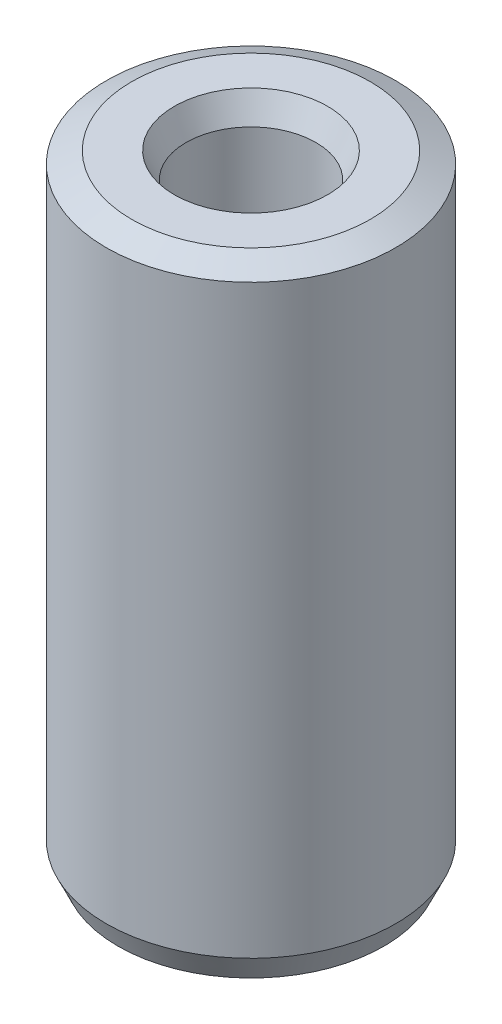
ISO-10303-21;
HEADER;
FILE_DESCRIPTION(('STEP AP214'),'2;1');
FILE_NAME('part.step','',(''),(''),'','','');
FILE_SCHEMA(('AUTOMOTIVE_DESIGN { 1 0 10303 214 1 1 1 1 }'));
ENDSEC;
DATA;
#1=APPLICATION_CONTEXT('core data for automotive mechanical design processes');
#2=APPLICATION_PROTOCOL_DEFINITION('international standard','automotive_design',2000,#1);
#3=PRODUCT_CONTEXT('',#1,'mechanical');
#4=PRODUCT('Part','Part','',(#3));
#5=PRODUCT_RELATED_PRODUCT_CATEGORY('part','',(#4));
#6=PRODUCT_DEFINITION_FORMATION('','',#4);
#7=PRODUCT_DEFINITION_CONTEXT('part definition',#1,'design');
#8=PRODUCT_DEFINITION('design','',#6,#7);
#9=PRODUCT_DEFINITION_SHAPE('','',#8);
#10=(LENGTH_UNIT() NAMED_UNIT(*) SI_UNIT(.MILLI.,.METRE.));
#11=(NAMED_UNIT(*) PLANE_ANGLE_UNIT() SI_UNIT($,.RADIAN.));
#12=(NAMED_UNIT(*) SI_UNIT($,.STERADIAN.) SOLID_ANGLE_UNIT());
#13=UNCERTAINTY_MEASURE_WITH_UNIT(LENGTH_MEASURE(1.E-05),#10,'distance_accuracy_value','');
#14=(GEOMETRIC_REPRESENTATION_CONTEXT(3) GLOBAL_UNCERTAINTY_ASSIGNED_CONTEXT((#13)) GLOBAL_UNIT_ASSIGNED_CONTEXT((#10,
#11,#12)) REPRESENTATION_CONTEXT('',''));
#15=CARTESIAN_POINT('',(0.,0.,0.));
#16=DIRECTION('',(0.,0.,1.));
#17=DIRECTION('',(1.,0.,0.));
#18=AXIS2_PLACEMENT_3D('',#15,#16,#17);
#19=CARTESIAN_POINT('',(0.,21.5110032312144,0.));
#20=DIRECTION('',(0.,-1.,0.));
#21=DIRECTION('',(0.,0.,-1.));
#22=AXIS2_PLACEMENT_3D('',#19,#20,#21);
#23=CYLINDRICAL_SURFACE('',#22,5.);
#24=CARTESIAN_POINT('',(0.,0.877956716879066,0.));
#25=DIRECTION('',(0.,1.,0.));
#26=DIRECTION('',(0.,0.,1.));
#27=AXIS2_PLACEMENT_3D('',#24,#25,#26);
#28=CIRCLE('',#27,5.);
#29=CARTESIAN_POINT('',(0.,0.877956716879062,-5.));
#30=VERTEX_POINT('',#29);
#31=EDGE_CURVE('E10',#30,#30,#28,.T.);
#32=CARTESIAN_POINT('',(0.,21.1034100459381,0.));
#33=DIRECTION('',(0.,1.,0.));
#34=DIRECTION('',(0.,0.,1.));
#35=AXIS2_PLACEMENT_3D('',#32,#33,#34);
#36=CIRCLE('',#35,5.);
#37=CARTESIAN_POINT('',(0.,21.1034100459381,-5.));
#38=VERTEX_POINT('',#37);
#39=EDGE_CURVE('E50',#38,#38,#36,.F.);
#40=CARTESIAN_POINT('',(0.,0.877956716879062,-5.));
#41=CARTESIAN_POINT('',(0.,1.08863852239009,-5.));
#42=CARTESIAN_POINT('',(0.,1.29932032790112,-5.));
#43=CARTESIAN_POINT('',(0.,1.72068393892319,-5.));
#44=CARTESIAN_POINT('',(0.,1.93136574443422,-5.));
#45=CARTESIAN_POINT('',(0.,2.35272935545628,-5.));
#46=CARTESIAN_POINT('',(0.,2.56341116096732,-5.));
#47=CARTESIAN_POINT('',(0.,2.98477477198938,-5.));
#48=CARTESIAN_POINT('',(0.,3.19545657750041,-5.));
#49=CARTESIAN_POINT('',(0.,3.61682018852248,-5.));
#50=CARTESIAN_POINT('',(0.,3.82750199403351,-5.));
#51=CARTESIAN_POINT('',(0.,4.24886560505557,-5.));
#52=CARTESIAN_POINT('',(0.,4.4595474105666,-5.));
#53=CARTESIAN_POINT('',(0.,4.88091102158867,-5.));
#54=CARTESIAN_POINT('',(0.,5.0915928270997,-5.));
#55=CARTESIAN_POINT('',(0.,5.51295643812176,-5.));
#56=CARTESIAN_POINT('',(0.,5.72363824363279,-5.));
#57=CARTESIAN_POINT('',(0.,6.14500185465486,-5.));
#58=CARTESIAN_POINT('',(0.,6.35568366016589,-5.));
#59=CARTESIAN_POINT('',(0.,6.77704727118795,-5.));
#60=CARTESIAN_POINT('',(0.,6.98772907669898,-5.));
#61=CARTESIAN_POINT('',(0.,7.40909268772105,-5.));
#62=CARTESIAN_POINT('',(0.,7.61977449323208,-5.));
#63=CARTESIAN_POINT('',(0.,8.04113810425414,-5.));
#64=CARTESIAN_POINT('',(0.,8.25181990976517,-5.));
#65=CARTESIAN_POINT('',(0.,8.67318352078724,-5.));
#66=CARTESIAN_POINT('',(0.,8.88386532629827,-5.));
#67=CARTESIAN_POINT('',(0.,9.30522893732033,-5.));
#68=CARTESIAN_POINT('',(0.,9.51591074283136,-5.));
#69=CARTESIAN_POINT('',(0.,9.93727435385343,-5.));
#70=CARTESIAN_POINT('',(0.,10.1479561593645,-5.));
#71=CARTESIAN_POINT('',(0.,10.5693197703865,-5.));
#72=CARTESIAN_POINT('',(0.,10.7800015758976,-5.));
#73=CARTESIAN_POINT('',(0.,11.2013651869196,-5.));
#74=CARTESIAN_POINT('',(0.,11.4120469924307,-5.));
#75=CARTESIAN_POINT('',(0.,11.8334106034527,-5.));
#76=CARTESIAN_POINT('',(0.,12.0440924089637,-5.));
#77=CARTESIAN_POINT('',(0.,12.4654560199858,-5.));
#78=CARTESIAN_POINT('',(0.,12.6761378254968,-5.));
#79=CARTESIAN_POINT('',(0.,13.0975014365189,-5.));
#80=CARTESIAN_POINT('',(0.,13.3081832420299,-5.));
#81=CARTESIAN_POINT('',(0.,13.729546853052,-5.));
#82=CARTESIAN_POINT('',(0.,13.940228658563,-5.));
#83=CARTESIAN_POINT('',(0.,14.3615922695851,-5.));
#84=CARTESIAN_POINT('',(0.,14.5722740750961,-5.));
#85=CARTESIAN_POINT('',(0.,14.9936376861182,-5.));
#86=CARTESIAN_POINT('',(0.,15.2043194916292,-5.));
#87=CARTESIAN_POINT('',(0.,15.6256831026513,-5.));
#88=CARTESIAN_POINT('',(0.,15.8363649081623,-5.));
#89=CARTESIAN_POINT('',(0.,16.2577285191844,-5.));
#90=CARTESIAN_POINT('',(0.,16.4684103246954,-5.));
#91=CARTESIAN_POINT('',(0.,16.8897739357175,-5.));
#92=CARTESIAN_POINT('',(0.,17.1004557412285,-5.));
#93=CARTESIAN_POINT('',(0.,17.5218193522506,-5.));
#94=CARTESIAN_POINT('',(0.,17.7325011577616,-5.));
#95=CARTESIAN_POINT('',(0.,18.1538647687837,-5.));
#96=CARTESIAN_POINT('',(0.,18.3645465742947,-5.));
#97=CARTESIAN_POINT('',(0.,18.7859101853168,-5.));
#98=CARTESIAN_POINT('',(0.,18.9965919908278,-5.));
#99=CARTESIAN_POINT('',(0.,19.4179556018499,-5.));
#100=CARTESIAN_POINT('',(0.,19.6286374073609,-5.));
#101=CARTESIAN_POINT('',(0.,20.050001018383,-5.));
#102=CARTESIAN_POINT('',(0.,20.260682823894,-5.));
#103=CARTESIAN_POINT('',(0.,20.682046434916,-5.));
#104=CARTESIAN_POINT('',(0.,20.8927282404271,-5.));
#105=CARTESIAN_POINT('',(0.,21.1034100459381,-5.));
#106=B_SPLINE_CURVE_WITH_KNOTS('',3,(#40,#41,#42,#43,#44,#45,#46,#47,#48,#49,#50,#51,#52,#53,
#54,#55,#56,#57,#58,#59,#60,#61,#62,#63,#64,#65,#66,#67,#68,#69,#70,#71,#72,#73,#74,#75,#76,#77,
#78,#79,#80,#81,#82,#83,#84,#85,#86,#87,#88,#89,#90,#91,#92,#93,#94,#95,#96,#97,#98,#99,#100,
#101,#102,#103,#104,#105),.UNSPECIFIED.,.F.,.F.,(4,2,2,2,2,2,2,2,2,2,2,2,2,2,2,2,2,2,2,2,2,2,2,
2,2,2,2,2,2,2,2,2,4),(0.,0.632045416533094,1.26409083306619,1.89613624959929,2.52818166613238,
3.16022708266548,3.79227249919857,4.42431791573167,5.05636333226476,5.68840874879786,
6.32045416533095,6.95249958186405,7.58454499839714,8.21659041493024,8.84863583146334,
9.48068124799643,10.1127266645295,10.7447720810626,11.3768174975957,12.0088629141288,
12.6409083306619,13.272953747195,13.9049991637281,14.5370445802612,15.1690899967943,
15.8011354133274,16.4331808298605,17.0652262463936,17.6972716629267,18.3293170794598,
18.9613624959929,19.593407912526,20.2254533290591),.UNSPECIFIED.);
#107=EDGE_CURVE('BSEAM39',#30,#38,#106,.T.);
#108=ORIENTED_EDGE('',*,*,#31,.T.);
#109=ORIENTED_EDGE('',*,*,#39,.T.);
#110=ORIENTED_EDGE('',*,*,#107,.T.);
#111=ORIENTED_EDGE('',*,*,#107,.F.);
#112=EDGE_LOOP('',(#108,#110,#109,#111));
#113=FACE_BOUND('',#112,.T.);
#114=ADVANCED_FACE('F39',(#113),#23,.T.);
#115=CARTESIAN_POINT('',(0.,21.5110032312144,0.));
#116=DIRECTION('',(0.,1.,0.));
#117=DIRECTION('',(0.,0.,1.));
#118=AXIS2_PLACEMENT_3D('',#115,#116,#117);
#119=PLANE('',#118);
#120=CARTESIAN_POINT('',(0.,21.5110032312144,0.));
#121=DIRECTION('',(0.,1.,0.));
#122=DIRECTION('',(0.,0.,1.));
#123=AXIS2_PLACEMENT_3D('',#120,#121,#122);
#124=CIRCLE('',#123,2.64845382721295);
#125=CARTESIAN_POINT('',(0.,21.5110032312144,2.64845382721295));
#126=VERTEX_POINT('',#125);
#127=EDGE_CURVE('E58',#126,#126,#124,.F.);
#128=ORIENTED_EDGE('',*,*,#127,.T.);
#129=EDGE_LOOP('',(#128));
#130=FACE_BOUND('',#129,.T.);
#131=CARTESIAN_POINT('',(0.,21.5110032312144,0.));
#132=DIRECTION('',(0.,1.,0.));
#133=DIRECTION('',(0.,0.,1.));
#134=AXIS2_PLACEMENT_3D('',#131,#132,#133);
#135=CIRCLE('',#134,4.12204328312103);
#136=CARTESIAN_POINT('',(0.,21.5110032312144,4.12204328312103));
#137=VERTEX_POINT('',#136);
#138=EDGE_CURVE('E61',#137,#137,#135,.T.);
#139=ORIENTED_EDGE('',*,*,#138,.T.);
#140=EDGE_LOOP('',(#139));
#141=FACE_BOUND('',#140,.T.);
#142=ADVANCED_FACE('F88',(#130,#141),#119,.T.);
#143=CARTESIAN_POINT('',(0.,0.,0.));
#144=DIRECTION('',(0.,1.,0.));
#145=DIRECTION('',(0.,0.,1.));
#146=AXIS2_PLACEMENT_3D('',#143,#144,#145);
#147=PLANE('',#146);
#148=CARTESIAN_POINT('',(0.,0.,0.));
#149=DIRECTION('',(0.,1.,0.));
#150=DIRECTION('',(0.,0.,1.));
#151=AXIS2_PLACEMENT_3D('',#148,#149,#150);
#152=CIRCLE('',#151,3.11881735881564);
#153=CARTESIAN_POINT('',(0.,0.,-3.11881735881564));
#154=VERTEX_POINT('',#153);
#155=EDGE_CURVE('E51',#154,#154,#152,.T.);
#156=ORIENTED_EDGE('',*,*,#155,.T.);
#157=EDGE_LOOP('',(#156));
#158=FACE_BOUND('',#157,.T.);
#159=CARTESIAN_POINT('',(0.,0.,0.));
#160=DIRECTION('',(0.,1.,0.));
#161=DIRECTION('',(0.,0.,1.));
#162=AXIS2_PLACEMENT_3D('',#159,#160,#161);
#163=CIRCLE('',#162,4.5924068147237);
#164=CARTESIAN_POINT('',(0.,0.,4.5924068147237));
#165=VERTEX_POINT('',#164);
#166=EDGE_CURVE('E54',#165,#165,#163,.F.);
#167=ORIENTED_EDGE('',*,*,#166,.T.);
#168=EDGE_LOOP('',(#167));
#169=FACE_BOUND('',#168,.T.);
#170=ADVANCED_FACE('F83',(#158,#169),#147,.F.);
#171=CARTESIAN_POINT('',(0.,21.5110032312144,0.));
#172=DIRECTION('',(0.,-1.,0.));
#173=DIRECTION('',(0.,0.,-1.));
#174=AXIS2_PLACEMENT_3D('',#171,#172,#173);
#175=CYLINDRICAL_SURFACE('',#174,2.24086064193667);
#176=CARTESIAN_POINT('',(0.,20.6330465143353,0.));
#177=DIRECTION('',(0.,1.,0.));
#178=DIRECTION('',(0.,0.,1.));
#179=AXIS2_PLACEMENT_3D('',#176,#177,#178);
#180=CIRCLE('',#179,2.24086064193667);
#181=CARTESIAN_POINT('',(0.,20.6330465143353,-2.24086064193667));
#182=VERTEX_POINT('',#181);
#183=EDGE_CURVE('E67',#182,#182,#180,.T.);
#184=CARTESIAN_POINT('',(0.,0.407593185276261,0.));
#185=DIRECTION('',(0.,1.,0.));
#186=DIRECTION('',(0.,0.,1.));
#187=AXIS2_PLACEMENT_3D('',#184,#185,#186);
#188=CIRCLE('',#187,2.24086064193667);
#189=CARTESIAN_POINT('',(0.,0.407593185276257,-2.24086064193667));
#190=VERTEX_POINT('',#189);
#191=EDGE_CURVE('E69',#190,#190,#188,.F.);
#192=CARTESIAN_POINT('',(0.,20.6330465143353,-2.24086064193667));
#193=CARTESIAN_POINT('',(0.,20.4223647088243,-2.24086064193667));
#194=CARTESIAN_POINT('',(0.,20.2116829033133,-2.24086064193667));
#195=CARTESIAN_POINT('',(0.,19.7903192922912,-2.24086064193667));
#196=CARTESIAN_POINT('',(0.,19.5796374867802,-2.24086064193667));
#197=CARTESIAN_POINT('',(0.,19.1582738757581,-2.24086064193667));
#198=CARTESIAN_POINT('',(0.,18.9475920702471,-2.24086064193667));
#199=CARTESIAN_POINT('',(0.,18.526228459225,-2.24086064193667));
#200=CARTESIAN_POINT('',(0.,18.315546653714,-2.24086064193667));
#201=CARTESIAN_POINT('',(0.,17.8941830426919,-2.24086064193667));
#202=CARTESIAN_POINT('',(0.,17.6835012371809,-2.24086064193667));
#203=CARTESIAN_POINT('',(0.,17.2621376261588,-2.24086064193667));
#204=CARTESIAN_POINT('',(0.,17.0514558206478,-2.24086064193667));
#205=CARTESIAN_POINT('',(0.,16.6300922096257,-2.24086064193667));
#206=CARTESIAN_POINT('',(0.,16.4194104041147,-2.24086064193667));
#207=CARTESIAN_POINT('',(0.,15.9980467930926,-2.24086064193667));
#208=CARTESIAN_POINT('',(0.,15.7873649875816,-2.24086064193667));
#209=CARTESIAN_POINT('',(0.,15.3660013765595,-2.24086064193667));
#210=CARTESIAN_POINT('',(0.,15.1553195710485,-2.24086064193667));
#211=CARTESIAN_POINT('',(0.,14.7339559600264,-2.24086064193667));
#212=CARTESIAN_POINT('',(0.,14.5232741545154,-2.24086064193667));
#213=CARTESIAN_POINT('',(0.,14.1019105434933,-2.24086064193667));
#214=CARTESIAN_POINT('',(0.,13.8912287379823,-2.24086064193667));
#215=CARTESIAN_POINT('',(0.,13.4698651269602,-2.24086064193667));
#216=CARTESIAN_POINT('',(0.,13.2591833214492,-2.24086064193667));
#217=CARTESIAN_POINT('',(0.,12.8378197104272,-2.24086064193667));
#218=CARTESIAN_POINT('',(0.,12.6271379049161,-2.24086064193667));
#219=CARTESIAN_POINT('',(0.,12.2057742938941,-2.24086064193667));
#220=CARTESIAN_POINT('',(0.,11.995092488383,-2.24086064193667));
#221=CARTESIAN_POINT('',(0.,11.573728877361,-2.24086064193667));
#222=CARTESIAN_POINT('',(0.,11.3630470718499,-2.24086064193667));
#223=CARTESIAN_POINT('',(0.,10.9416834608279,-2.24086064193667));
#224=CARTESIAN_POINT('',(0.,10.7310016553168,-2.24086064193667));
#225=CARTESIAN_POINT('',(0.,10.3096380442948,-2.24086064193667));
#226=CARTESIAN_POINT('',(0.,10.0989562387837,-2.24086064193667));
#227=CARTESIAN_POINT('',(0.,9.67759262776167,-2.24086064193667));
#228=CARTESIAN_POINT('',(0.,9.46691082225064,-2.24086064193667));
#229=CARTESIAN_POINT('',(0.,9.04554721122857,-2.24086064193667));
#230=CARTESIAN_POINT('',(0.,8.83486540571754,-2.24086064193667));
#231=CARTESIAN_POINT('',(0.,8.41350179469548,-2.24086064193667));
#232=CARTESIAN_POINT('',(0.,8.20281998918444,-2.24086064193667));
#233=CARTESIAN_POINT('',(0.,7.78145637816238,-2.24086064193667));
#234=CARTESIAN_POINT('',(0.,7.57077457265135,-2.24086064193667));
#235=CARTESIAN_POINT('',(0.,7.14941096162929,-2.24086064193667));
#236=CARTESIAN_POINT('',(0.,6.93872915611825,-2.24086064193667));
#237=CARTESIAN_POINT('',(0.,6.51736554509619,-2.24086064193667));
#238=CARTESIAN_POINT('',(0.,6.30668373958516,-2.24086064193667));
#239=CARTESIAN_POINT('',(0.,5.88532012856309,-2.24086064193667));
#240=CARTESIAN_POINT('',(0.,5.67463832305206,-2.24086064193667));
#241=CARTESIAN_POINT('',(0.,5.25327471203,-2.24086064193667));
#242=CARTESIAN_POINT('',(0.,5.04259290651896,-2.24086064193667));
#243=CARTESIAN_POINT('',(0.,4.6212292954969,-2.24086064193667));
#244=CARTESIAN_POINT('',(0.,4.41054748998587,-2.24086064193667));
#245=CARTESIAN_POINT('',(0.,3.9891838789638,-2.24086064193667));
#246=CARTESIAN_POINT('',(0.,3.77850207345277,-2.24086064193667));
#247=CARTESIAN_POINT('',(0.,3.35713846243071,-2.24086064193667));
#248=CARTESIAN_POINT('',(0.,3.14645665691968,-2.24086064193667));
#249=CARTESIAN_POINT('',(0.,2.72509304589761,-2.24086064193667));
#250=CARTESIAN_POINT('',(0.,2.51441124038658,-2.24086064193667));
#251=CARTESIAN_POINT('',(0.,2.09304762936451,-2.24086064193667));
#252=CARTESIAN_POINT('',(0.,1.88236582385348,-2.24086064193667));
#253=CARTESIAN_POINT('',(0.,1.46100221283142,-2.24086064193667));
#254=CARTESIAN_POINT('',(0.,1.25032040732039,-2.24086064193667));
#255=CARTESIAN_POINT('',(0.,0.828956796298322,-2.24086064193667));
#256=CARTESIAN_POINT('',(0.,0.61827499078729,-2.24086064193667));
#257=CARTESIAN_POINT('',(0.,0.407593185276257,-2.24086064193667));
#258=B_SPLINE_CURVE_WITH_KNOTS('',3,(#192,#193,#194,#195,#196,#197,#198,#199,#200,#201,#202,
#203,#204,#205,#206,#207,#208,#209,#210,#211,#212,#213,#214,#215,#216,#217,#218,#219,#220,#221,
#222,#223,#224,#225,#226,#227,#228,#229,#230,#231,#232,#233,#234,#235,#236,#237,#238,#239,#240,
#241,#242,#243,#244,#245,#246,#247,#248,#249,#250,#251,#252,#253,#254,#255,#256,#257),
.UNSPECIFIED.,.F.,.F.,(4,2,2,2,2,2,2,2,2,2,2,2,2,2,2,2,2,2,2,2,2,2,2,2,2,2,2,2,2,2,2,2,4),(0.,
0.632045416533094,1.26409083306619,1.89613624959929,2.52818166613238,3.16022708266548,
3.79227249919857,4.42431791573167,5.05636333226477,5.68840874879786,6.32045416533096,
6.95249958186406,7.58454499839715,8.21659041493025,8.84863583146334,9.48068124799644,
10.1127266645295,10.7447720810626,11.3768174975957,12.0088629141288,12.6409083306619,
13.272953747195,13.9049991637281,14.5370445802612,15.1690899967943,15.8011354133274,
16.4331808298605,17.0652262463936,17.6972716629267,18.3293170794598,18.9613624959929,
19.593407912526,20.2254533290591),.UNSPECIFIED.);
#259=EDGE_CURVE('BSEAM71',#182,#190,#258,.T.);
#260=ORIENTED_EDGE('',*,*,#183,.T.);
#261=ORIENTED_EDGE('',*,*,#191,.T.);
#262=ORIENTED_EDGE('',*,*,#259,.T.);
#263=ORIENTED_EDGE('',*,*,#259,.F.);
#264=EDGE_LOOP('',(#260,#262,#261,#263));
#265=FACE_BOUND('',#264,.T.);
#266=ADVANCED_FACE('F71',(#265),#175,.F.);
#267=CARTESIAN_POINT('',(0.,20.6330465143353,0.));
#268=DIRECTION('',(0.,1.,0.));
#269=DIRECTION('',(0.,0.,1.));
#270=AXIS2_PLACEMENT_3D('',#267,#268,#269);
#271=CONICAL_SURFACE('',#270,2.24086064193667,0.434642501289307);
#272=ORIENTED_EDGE('',*,*,#127,.F.);
#273=EDGE_LOOP('',(#272));
#274=FACE_BOUND('',#273,.T.);
#275=ORIENTED_EDGE('',*,*,#183,.F.);
#276=EDGE_LOOP('',(#275));
#277=FACE_BOUND('',#276,.T.);
#278=ADVANCED_FACE('F77',(#274,#277),#271,.F.);
#279=CARTESIAN_POINT('',(0.,0.,0.));
#280=DIRECTION('',(0.,-1.,0.));
#281=DIRECTION('',(0.,0.,-1.));
#282=AXIS2_PLACEMENT_3D('',#279,#280,#281);
#283=CONICAL_SURFACE('',#282,3.11881735881564,1.13615382550558);
#284=CARTESIAN_POINT('',(0.,0.407593185276261,-2.24086064193667));
#285=CARTESIAN_POINT('',(0.,0.403347422929633,-2.25000602440415));
#286=CARTESIAN_POINT('',(0.,0.399101660583005,-2.25915140687164));
#287=CARTESIAN_POINT('',(0.,0.39061013588975,-2.27744217180662));
#288=CARTESIAN_POINT('',(0.,0.386364373543122,-2.28658755427411));
#289=CARTESIAN_POINT('',(0.,0.377872848849867,-2.30487831920909));
#290=CARTESIAN_POINT('',(0.,0.373627086503239,-2.31402370167658));
#291=CARTESIAN_POINT('',(0.,0.365135561809984,-2.33231446661156));
#292=CARTESIAN_POINT('',(0.,0.360889799463356,-2.34145984907905));
#293=CARTESIAN_POINT('',(0.,0.3523982747701,-2.35975061401403));
#294=CARTESIAN_POINT('',(0.,0.348152512423473,-2.36889599648152));
#295=CARTESIAN_POINT('',(0.,0.339660987730217,-2.38718676141649));
#296=CARTESIAN_POINT('',(0.,0.33541522538359,-2.39633214388398));
#297=CARTESIAN_POINT('',(0.,0.326923700690334,-2.41462290881896));
#298=CARTESIAN_POINT('',(0.,0.322677938343706,-2.42376829128645));
#299=CARTESIAN_POINT('',(0.,0.314186413650451,-2.44205905622143));
#300=CARTESIAN_POINT('',(0.,0.309940651303823,-2.45120443868892));
#301=CARTESIAN_POINT('',(0.,0.301449126610568,-2.4694952036239));
#302=CARTESIAN_POINT('',(0.,0.29720336426394,-2.47864058609139));
#303=CARTESIAN_POINT('',(0.,0.288711839570685,-2.49693135102636));
#304=CARTESIAN_POINT('',(0.,0.284466077224057,-2.50607673349385));
#305=CARTESIAN_POINT('',(0.,0.275974552530802,-2.52436749842883));
#306=CARTESIAN_POINT('',(0.,0.271728790184174,-2.53351288089632));
#307=CARTESIAN_POINT('',(0.,0.263237265490918,-2.5518036458313));
#308=CARTESIAN_POINT('',(0.,0.258991503144291,-2.56094902829879));
#309=CARTESIAN_POINT('',(0.,0.250499978451035,-2.57923979323377));
#310=CARTESIAN_POINT('',(0.,0.246254216104408,-2.58838517570126));
#311=CARTESIAN_POINT('',(0.,0.237762691411152,-2.60667594063624));
#312=CARTESIAN_POINT('',(0.,0.233516929064524,-2.61582132310373));
#313=CARTESIAN_POINT('',(0.,0.225025404371269,-2.6341120880387));
#314=CARTESIAN_POINT('',(0.,0.220779642024641,-2.64325747050619));
#315=CARTESIAN_POINT('',(0.,0.212288117331386,-2.66154823544117));
#316=CARTESIAN_POINT('',(0.,0.208042354984758,-2.67069361790866));
#317=CARTESIAN_POINT('',(0.,0.199550830291503,-2.68898438284364));
#318=CARTESIAN_POINT('',(0.,0.195305067944875,-2.69812976531113));
#319=CARTESIAN_POINT('',(0.,0.18681354325162,-2.71642053024611));
#320=CARTESIAN_POINT('',(0.,0.182567780904992,-2.7255659127136));
#321=CARTESIAN_POINT('',(0.,0.174076256211736,-2.74385667764858));
#322=CARTESIAN_POINT('',(0.,0.169830493865109,-2.75300206011606));
#323=CARTESIAN_POINT('',(0.,0.161338969171853,-2.77129282505104));
#324=CARTESIAN_POINT('',(0.,0.157093206825226,-2.78043820751853));
#325=CARTESIAN_POINT('',(0.,0.14860168213197,-2.79872897245351));
#326=CARTESIAN_POINT('',(0.,0.144355919785342,-2.807874354921));
#327=CARTESIAN_POINT('',(0.,0.135864395092087,-2.82616511985598));
#328=CARTESIAN_POINT('',(0.,0.131618632745459,-2.83531050232347));
#329=CARTESIAN_POINT('',(0.,0.123127108052204,-2.85360126725845));
#330=CARTESIAN_POINT('',(0.,0.118881345705576,-2.86274664972594));
#331=CARTESIAN_POINT('',(0.,0.110389821012321,-2.88103741466092));
#332=CARTESIAN_POINT('',(0.,0.106144058665693,-2.8901827971284));
#333=CARTESIAN_POINT('',(0.,0.0976525339724374,-2.90847356206338));
#334=CARTESIAN_POINT('',(0.,0.0934067716258098,-2.91761894453087));
#335=CARTESIAN_POINT('',(0.,0.0849152469325543,-2.93590970946585));
#336=CARTESIAN_POINT('',(0.,0.0806694845859266,-2.94505509193334));
#337=CARTESIAN_POINT('',(0.,0.0721779598926712,-2.96334585686832));
#338=CARTESIAN_POINT('',(0.,0.0679321975460435,-2.97249123933581));
#339=CARTESIAN_POINT('',(0.,0.059440672852788,-2.99078200427079));
#340=CARTESIAN_POINT('',(0.,0.0551949105061603,-2.99992738673828));
#341=CARTESIAN_POINT('',(0.,0.0467033858129049,-3.01821815167325));
#342=CARTESIAN_POINT('',(0.,0.0424576234662772,-3.02736353414074));
#343=CARTESIAN_POINT('',(0.,0.0339660987730217,-3.04565429907572));
#344=CARTESIAN_POINT('',(0.,0.029720336426394,-3.05479968154321));
#345=CARTESIAN_POINT('',(0.,0.0212288117331386,-3.07309044647819));
#346=CARTESIAN_POINT('',(0.,0.0169830493865109,-3.08223582894568));
#347=CARTESIAN_POINT('',(0.,0.00849152469325543,-3.10052659388066));
#348=CARTESIAN_POINT('',(0.,0.00424576234662773,-3.10967197634815));
#349=CARTESIAN_POINT('',(0.,0.,-3.11881735881564));
#350=B_SPLINE_CURVE_WITH_KNOTS('',3,(#284,#285,#286,#287,#288,#289,#290,#291,#292,#293,#294,
#295,#296,#297,#298,#299,#300,#301,#302,#303,#304,#305,#306,#307,#308,#309,#310,#311,#312,#313,
#314,#315,#316,#317,#318,#319,#320,#321,#322,#323,#324,#325,#326,#327,#328,#329,#330,#331,#332,
#333,#334,#335,#336,#337,#338,#339,#340,#341,#342,#343,#344,#345,#346,#347,#348,#349),
.UNSPECIFIED.,.F.,.F.,(4,2,2,2,2,2,2,2,2,2,2,2,2,2,2,2,2,2,2,2,2,2,2,2,2,2,2,2,2,2,2,2,4),(0.,
0.0302486473321754,0.0604972946643507,0.0907459419965261,0.120994589328701,0.151243236660876,
0.181491883993052,0.211740531325227,0.241989178657403,0.272237825989578,0.302486473321753,
0.332735120653929,0.362983767986104,0.393232415318279,0.423481062650455,0.45372970998263,
0.483978357314805,0.514227004646981,0.544475651979156,0.574724299311331,0.604972946643507,
0.635221593975682,0.665470241307857,0.695718888640033,0.725967535972208,0.756216183304383,
0.786464830636558,0.816713477968734,0.846962125300909,0.877210772633085,0.90745941996526,
0.937708067297435,0.967956714629611),.UNSPECIFIED.);
#351=EDGE_CURVE('BSEAM73',#190,#154,#350,.T.);
#352=ORIENTED_EDGE('',*,*,#191,.F.);
#353=ORIENTED_EDGE('',*,*,#155,.F.);
#354=ORIENTED_EDGE('',*,*,#351,.T.);
#355=ORIENTED_EDGE('',*,*,#351,.F.);
#356=EDGE_LOOP('',(#352,#354,#353,#355));
#357=FACE_BOUND('',#356,.T.);
#358=ADVANCED_FACE('F73',(#357),#283,.F.);
#359=CARTESIAN_POINT('',(0.,0.877956716879062,0.));
#360=DIRECTION('',(0.,1.,0.));
#361=DIRECTION('',(0.,0.,1.));
#362=AXIS2_PLACEMENT_3D('',#359,#360,#361);
#363=CONICAL_SURFACE('',#362,5.,0.434642501289312);
#364=ORIENTED_EDGE('',*,*,#166,.F.);
#365=EDGE_LOOP('',(#364));
#366=FACE_BOUND('',#365,.T.);
#367=ORIENTED_EDGE('',*,*,#31,.F.);
#368=EDGE_LOOP('',(#367));
#369=FACE_BOUND('',#368,.T.);
#370=ADVANCED_FACE('F76',(#366,#369),#363,.T.);
#371=CARTESIAN_POINT('',(0.,21.5110032312144,0.));
#372=DIRECTION('',(0.,-1.,0.));
#373=DIRECTION('',(0.,0.,-1.));
#374=AXIS2_PLACEMENT_3D('',#371,#372,#373);
#375=CONICAL_SURFACE('',#374,4.12204328312103,1.13615382550559);
#376=ORIENTED_EDGE('',*,*,#39,.F.);
#377=EDGE_LOOP('',(#376));
#378=FACE_BOUND('',#377,.T.);
#379=ORIENTED_EDGE('',*,*,#138,.F.);
#380=EDGE_LOOP('',(#379));
#381=FACE_BOUND('',#380,.T.);
#382=ADVANCED_FACE('F45',(#378,#381),#375,.T.);
#383=CLOSED_SHELL('',(#114,#142,#170,#266,#278,#358,#370,#382));
#384=MANIFOLD_SOLID_BREP('B2',#383);
#385=ADVANCED_BREP_SHAPE_REPRESENTATION('',(#18,#384),#14);
#386=SHAPE_DEFINITION_REPRESENTATION(#9,#385);
ENDSEC;
END-ISO-10303-21;
